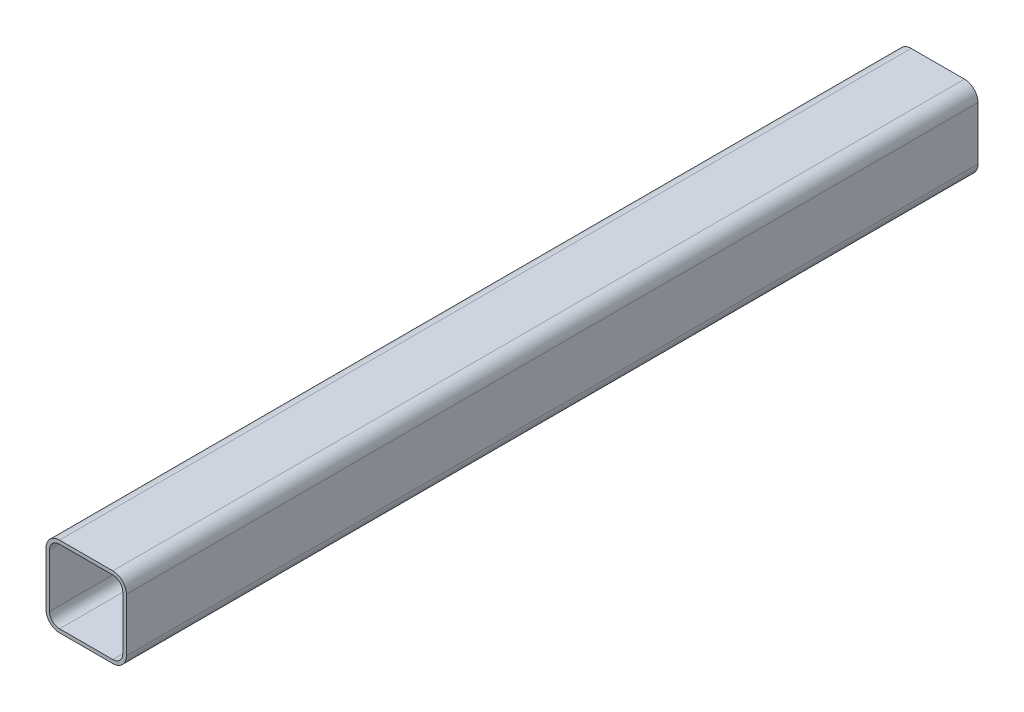
ISO-10303-21;
HEADER;
FILE_DESCRIPTION(('STEP AP214'),'2;1');
FILE_NAME('part.step','',(''),(''),'','','');
FILE_SCHEMA(('AUTOMOTIVE_DESIGN { 1 0 10303 214 1 1 1 1 }'));
ENDSEC;
DATA;
#1=APPLICATION_CONTEXT('core data for automotive mechanical design processes');
#2=APPLICATION_PROTOCOL_DEFINITION('international standard','automotive_design',2000,#1);
#3=PRODUCT_CONTEXT('',#1,'mechanical');
#4=PRODUCT('Part','Part','',(#3));
#5=PRODUCT_RELATED_PRODUCT_CATEGORY('part','',(#4));
#6=PRODUCT_DEFINITION_FORMATION('','',#4);
#7=PRODUCT_DEFINITION_CONTEXT('part definition',#1,'design');
#8=PRODUCT_DEFINITION('design','',#6,#7);
#9=PRODUCT_DEFINITION_SHAPE('','',#8);
#10=(LENGTH_UNIT() NAMED_UNIT(*) SI_UNIT(.MILLI.,.METRE.));
#11=(NAMED_UNIT(*) PLANE_ANGLE_UNIT() SI_UNIT($,.RADIAN.));
#12=(NAMED_UNIT(*) SI_UNIT($,.STERADIAN.) SOLID_ANGLE_UNIT());
#13=UNCERTAINTY_MEASURE_WITH_UNIT(LENGTH_MEASURE(1.E-05),#10,'distance_accuracy_value','');
#14=(GEOMETRIC_REPRESENTATION_CONTEXT(3) GLOBAL_UNCERTAINTY_ASSIGNED_CONTEXT((#13)) GLOBAL_UNIT_ASSIGNED_CONTEXT((#10,
#11,#12)) REPRESENTATION_CONTEXT('',''));
#15=CARTESIAN_POINT('',(0.,0.,0.));
#16=DIRECTION('',(0.,0.,1.));
#17=DIRECTION('',(1.,0.,0.));
#18=AXIS2_PLACEMENT_3D('',#15,#16,#17);
#19=CARTESIAN_POINT('',(-14.3764,-14.3764,-152.4));
#20=DIRECTION('',(0.,0.,1.));
#21=DIRECTION('',(1.,0.,0.));
#22=AXIS2_PLACEMENT_3D('',#19,#20,#21);
#23=PLANE('',#22);
#24=DIRECTION('',(0.,1.,0.));
#25=VECTOR('',#24,1.);
#26=CARTESIAN_POINT('',(-13.1064,0.,-152.4));
#27=LINE('',#26,#25);
#28=CARTESIAN_POINT('',(-13.1064,-9.53452500032133,-152.4));
#29=VERTEX_POINT('',#28);
#30=CARTESIAN_POINT('',(-13.1064,9.53452499999941,-152.4));
#31=VERTEX_POINT('',#30);
#32=EDGE_CURVE('E158',#29,#31,#27,.T.);
#33=ORIENTED_EDGE('',*,*,#32,.F.);
#34=CARTESIAN_POINT('',(-9.534525,-9.53452500000119,-152.4));
#35=DIRECTION('',(0.,0.,-1.));
#36=DIRECTION('',(0.,1.,0.));
#37=AXIS2_PLACEMENT_3D('',#34,#35,#36);
#38=CIRCLE('',#37,3.571875);
#39=CARTESIAN_POINT('',(-9.53452499931297,-13.1064,-152.4));
#40=VERTEX_POINT('',#39);
#41=EDGE_CURVE('E209',#40,#29,#38,.T.);
#42=ORIENTED_EDGE('',*,*,#41,.F.);
#43=DIRECTION('',(-1.,0.,0.));
#44=VECTOR('',#43,1.);
#45=CARTESIAN_POINT('',(0.,-13.1064,-152.4));
#46=LINE('',#45,#44);
#47=CARTESIAN_POINT('',(9.534525,-13.1064,-152.4));
#48=VERTEX_POINT('',#47);
#49=EDGE_CURVE('E154',#48,#40,#46,.T.);
#50=ORIENTED_EDGE('',*,*,#49,.F.);
#51=CARTESIAN_POINT('',(9.534525,-9.53452500000119,-152.4));
#52=DIRECTION('',(0.,0.,-1.));
#53=DIRECTION('',(0.,1.,0.));
#54=AXIS2_PLACEMENT_3D('',#51,#52,#53);
#55=CIRCLE('',#54,3.571875);
#56=CARTESIAN_POINT('',(13.1064,-9.5345250007332,-152.4));
#57=VERTEX_POINT('',#56);
#58=EDGE_CURVE('E213',#57,#48,#55,.T.);
#59=ORIENTED_EDGE('',*,*,#58,.F.);
#60=DIRECTION('',(0.,-1.,0.));
#61=VECTOR('',#60,1.);
#62=CARTESIAN_POINT('',(13.1064,0.,-152.4));
#63=LINE('',#62,#61);
#64=CARTESIAN_POINT('',(13.1064,9.53452499999941,-152.4));
#65=VERTEX_POINT('',#64);
#66=EDGE_CURVE('E163',#65,#57,#63,.T.);
#67=ORIENTED_EDGE('',*,*,#66,.F.);
#68=CARTESIAN_POINT('',(9.534525,9.53452499999882,-152.4));
#69=DIRECTION('',(0.,0.,-1.));
#70=DIRECTION('',(0.,1.,0.));
#71=AXIS2_PLACEMENT_3D('',#68,#69,#70);
#72=CIRCLE('',#71,3.571875);
#73=CARTESIAN_POINT('',(9.5345250003663,13.1064,-152.4));
#74=VERTEX_POINT('',#73);
#75=EDGE_CURVE('E216',#74,#65,#72,.T.);
#76=ORIENTED_EDGE('',*,*,#75,.F.);
#77=DIRECTION('',(1.,0.,0.));
#78=VECTOR('',#77,1.);
#79=CARTESIAN_POINT('',(0.,13.1064,-152.4));
#80=LINE('',#79,#78);
#81=CARTESIAN_POINT('',(-9.534525,13.1064,-152.4));
#82=VERTEX_POINT('',#81);
#83=EDGE_CURVE('E168',#82,#74,#80,.T.);
#84=ORIENTED_EDGE('',*,*,#83,.F.);
#85=CARTESIAN_POINT('',(-9.534525,9.53452499999882,-152.4));
#86=DIRECTION('',(0.,0.,-1.));
#87=DIRECTION('',(0.,1.,0.));
#88=AXIS2_PLACEMENT_3D('',#85,#86,#87);
#89=CIRCLE('',#88,3.571875);
#90=EDGE_CURVE('E161',#31,#82,#89,.T.);
#91=ORIENTED_EDGE('',*,*,#90,.F.);
#92=EDGE_LOOP('',(#33,#42,#50,#59,#67,#76,#84,#91));
#93=FACE_BOUND('',#92,.T.);
#94=DIRECTION('',(0.,-1.,0.));
#95=VECTOR('',#94,1.);
#96=CARTESIAN_POINT('',(14.3764,0.,-152.4));
#97=LINE('',#96,#95);
#98=CARTESIAN_POINT('',(14.3764,9.53452499999957,-152.4));
#99=VERTEX_POINT('',#98);
#100=CARTESIAN_POINT('',(14.3764,-9.53452500000044,-152.4));
#101=VERTEX_POINT('',#100);
#102=EDGE_CURVE('E162',#99,#101,#97,.T.);
#103=ORIENTED_EDGE('',*,*,#102,.T.);
#104=CARTESIAN_POINT('',(9.534525,-9.53452500000088,-152.4));
#105=DIRECTION('',(0.,0.,-1.));
#106=DIRECTION('',(0.,1.,0.));
#107=AXIS2_PLACEMENT_3D('',#104,#105,#106);
#108=CIRCLE('',#107,4.841875);
#109=CARTESIAN_POINT('',(9.53452500093131,-14.3764,-152.4));
#110=VERTEX_POINT('',#109);
#111=EDGE_CURVE('E221',#101,#110,#108,.T.);
#112=ORIENTED_EDGE('',*,*,#111,.T.);
#113=DIRECTION('',(-1.,0.,0.));
#114=VECTOR('',#113,1.);
#115=CARTESIAN_POINT('',(0.,-14.3764,-152.4));
#116=LINE('',#115,#114);
#117=CARTESIAN_POINT('',(-9.534525,-14.3764,-152.4));
#118=VERTEX_POINT('',#117);
#119=EDGE_CURVE('E174',#110,#118,#116,.T.);
#120=ORIENTED_EDGE('',*,*,#119,.T.);
#121=CARTESIAN_POINT('',(-9.534525,-9.53452500000088,-152.4));
#122=DIRECTION('',(0.,0.,-1.));
#123=DIRECTION('',(0.,1.,0.));
#124=AXIS2_PLACEMENT_3D('',#121,#122,#123);
#125=CIRCLE('',#124,4.841875);
#126=CARTESIAN_POINT('',(-14.3764,-9.53452500043521,-152.4));
#127=VERTEX_POINT('',#126);
#128=EDGE_CURVE('E225',#118,#127,#125,.T.);
#129=ORIENTED_EDGE('',*,*,#128,.T.);
#130=DIRECTION('',(0.,1.,0.));
#131=VECTOR('',#130,1.);
#132=CARTESIAN_POINT('',(-14.3764,0.,-152.4));
#133=LINE('',#132,#131);
#134=CARTESIAN_POINT('',(-14.3764,9.53452499999957,-152.4));
#135=VERTEX_POINT('',#134);
#136=EDGE_CURVE('E179',#127,#135,#133,.T.);
#137=ORIENTED_EDGE('',*,*,#136,.T.);
#138=CARTESIAN_POINT('',(-9.534525,9.53452499999913,-152.4));
#139=DIRECTION('',(0.,0.,-1.));
#140=DIRECTION('',(0.,1.,0.));
#141=AXIS2_PLACEMENT_3D('',#138,#139,#140);
#142=CIRCLE('',#141,4.841875);
#143=CARTESIAN_POINT('',(-9.53452499950346,14.3764,-152.4));
#144=VERTEX_POINT('',#143);
#145=EDGE_CURVE('E141',#135,#144,#142,.T.);
#146=ORIENTED_EDGE('',*,*,#145,.T.);
#147=DIRECTION('',(1.,0.,0.));
#148=VECTOR('',#147,1.);
#149=CARTESIAN_POINT('',(0.,14.3764,-152.4));
#150=LINE('',#149,#148);
#151=CARTESIAN_POINT('',(9.534525,14.3764,-152.4));
#152=VERTEX_POINT('',#151);
#153=EDGE_CURVE('E139',#144,#152,#150,.T.);
#154=ORIENTED_EDGE('',*,*,#153,.T.);
#155=CARTESIAN_POINT('',(9.534525,9.53452499999913,-152.4));
#156=DIRECTION('',(0.,0.,-1.));
#157=DIRECTION('',(0.,1.,0.));
#158=AXIS2_PLACEMENT_3D('',#155,#156,#157);
#159=CIRCLE('',#158,4.841875);
#160=EDGE_CURVE('E20',#152,#99,#159,.T.);
#161=ORIENTED_EDGE('',*,*,#160,.T.);
#162=EDGE_LOOP('',(#103,#112,#120,#129,#137,#146,#154,#161));
#163=FACE_BOUND('',#162,.T.);
#164=ADVANCED_FACE('F16',(#93,#163),#23,.F.);
#165=CARTESIAN_POINT('',(9.534525,9.534525,152.4));
#166=DIRECTION('',(0.,0.,-1.));
#167=DIRECTION('',(0.,1.,0.));
#168=AXIS2_PLACEMENT_3D('',#165,#166,#167);
#169=CYLINDRICAL_SURFACE('',#168,4.841875);
#170=DIRECTION('',(0.,0.,1.));
#171=VECTOR('',#170,1.);
#172=CARTESIAN_POINT('',(9.534525,14.3764,0.));
#173=LINE('',#172,#171);
#174=CARTESIAN_POINT('',(9.534525,14.3764,152.4));
#175=VERTEX_POINT('',#174);
#176=EDGE_CURVE('E131',#152,#175,#173,.T.);
#177=ORIENTED_EDGE('',*,*,#176,.T.);
#178=CARTESIAN_POINT('',(9.534525,9.534525,152.4));
#179=DIRECTION('',(0.,0.,-1.));
#180=DIRECTION('',(0.,1.,0.));
#181=AXIS2_PLACEMENT_3D('',#178,#179,#180);
#182=CIRCLE('',#181,4.841875);
#183=CARTESIAN_POINT('',(14.3764,9.534525,152.4));
#184=VERTEX_POINT('',#183);
#185=EDGE_CURVE('E207',#184,#175,#182,.F.);
#186=ORIENTED_EDGE('',*,*,#185,.F.);
#187=DIRECTION('',(0.,0.,-1.));
#188=VECTOR('',#187,1.);
#189=CARTESIAN_POINT('',(14.3764,9.534525,0.));
#190=LINE('',#189,#188);
#191=EDGE_CURVE('E134',#184,#99,#190,.T.);
#192=ORIENTED_EDGE('',*,*,#191,.T.);
#193=ORIENTED_EDGE('',*,*,#160,.F.);
#194=EDGE_LOOP('',(#177,#186,#192,#193));
#195=FACE_BOUND('',#194,.T.);
#196=ADVANCED_FACE('F129',(#195),#169,.T.);
#197=CARTESIAN_POINT('',(-9.534525,14.3764,152.4));
#198=DIRECTION('',(0.,-1.,0.));
#199=DIRECTION('',(0.,0.,-1.));
#200=AXIS2_PLACEMENT_3D('',#197,#198,#199);
#201=PLANE('',#200);
#202=DIRECTION('',(0.,0.,-1.));
#203=VECTOR('',#202,1.);
#204=CARTESIAN_POINT('',(-9.53452499900692,14.3764,0.));
#205=LINE('',#204,#203);
#206=CARTESIAN_POINT('',(-9.53452499950346,14.3764,152.4));
#207=VERTEX_POINT('',#206);
#208=EDGE_CURVE('E144',#144,#207,#205,.F.);
#209=ORIENTED_EDGE('',*,*,#208,.T.);
#210=DIRECTION('',(-1.,0.,0.));
#211=VECTOR('',#210,1.);
#212=CARTESIAN_POINT('',(0.,14.3764,152.4));
#213=LINE('',#212,#211);
#214=EDGE_CURVE('E148',#175,#207,#213,.T.);
#215=ORIENTED_EDGE('',*,*,#214,.F.);
#216=ORIENTED_EDGE('',*,*,#176,.F.);
#217=ORIENTED_EDGE('',*,*,#153,.F.);
#218=EDGE_LOOP('',(#209,#215,#216,#217));
#219=FACE_BOUND('',#218,.T.);
#220=ADVANCED_FACE('F146',(#219),#201,.F.);
#221=CARTESIAN_POINT('',(-9.534525,9.534525,152.4));
#222=DIRECTION('',(0.,0.,-1.));
#223=DIRECTION('',(0.,1.,0.));
#224=AXIS2_PLACEMENT_3D('',#221,#222,#223);
#225=CYLINDRICAL_SURFACE('',#224,4.841875);
#226=DIRECTION('',(0.,0.,1.));
#227=VECTOR('',#226,1.);
#228=CARTESIAN_POINT('',(-14.3764,9.534525,0.));
#229=LINE('',#228,#227);
#230=CARTESIAN_POINT('',(-14.3764,9.534525,152.4));
#231=VERTEX_POINT('',#230);
#232=EDGE_CURVE('E181',#135,#231,#229,.T.);
#233=ORIENTED_EDGE('',*,*,#232,.T.);
#234=CARTESIAN_POINT('',(-9.534525,9.534525,152.4));
#235=DIRECTION('',(0.,0.,-1.));
#236=DIRECTION('',(0.,1.,0.));
#237=AXIS2_PLACEMENT_3D('',#234,#235,#236);
#238=CIRCLE('',#237,4.841875);
#239=EDGE_CURVE('E204',#207,#231,#238,.F.);
#240=ORIENTED_EDGE('',*,*,#239,.F.);
#241=ORIENTED_EDGE('',*,*,#208,.F.);
#242=ORIENTED_EDGE('',*,*,#145,.F.);
#243=EDGE_LOOP('',(#233,#240,#241,#242));
#244=FACE_BOUND('',#243,.T.);
#245=ADVANCED_FACE('F229',(#244),#225,.T.);
#246=CARTESIAN_POINT('',(-14.3764,-9.534525,152.4));
#247=DIRECTION('',(1.,0.,0.));
#248=DIRECTION('',(0.,0.,-1.));
#249=AXIS2_PLACEMENT_3D('',#246,#247,#248);
#250=PLANE('',#249);
#251=DIRECTION('',(0.,0.,-1.));
#252=VECTOR('',#251,1.);
#253=CARTESIAN_POINT('',(-14.3764,-9.53452500086954,0.));
#254=LINE('',#253,#252);
#255=CARTESIAN_POINT('',(-14.3764,-9.53452500043477,152.4));
#256=VERTEX_POINT('',#255);
#257=EDGE_CURVE('E180',#127,#256,#254,.F.);
#258=ORIENTED_EDGE('',*,*,#257,.T.);
#259=DIRECTION('',(0.,-1.,0.));
#260=VECTOR('',#259,1.);
#261=CARTESIAN_POINT('',(-14.3764,0.,152.4));
#262=LINE('',#261,#260);
#263=EDGE_CURVE('E203',#231,#256,#262,.T.);
#264=ORIENTED_EDGE('',*,*,#263,.F.);
#265=ORIENTED_EDGE('',*,*,#232,.F.);
#266=ORIENTED_EDGE('',*,*,#136,.F.);
#267=EDGE_LOOP('',(#258,#264,#265,#266));
#268=FACE_BOUND('',#267,.T.);
#269=ADVANCED_FACE('F261',(#268),#250,.F.);
#270=CARTESIAN_POINT('',(-9.534525,-9.534525,152.4));
#271=DIRECTION('',(0.,0.,-1.));
#272=DIRECTION('',(0.,1.,0.));
#273=AXIS2_PLACEMENT_3D('',#270,#271,#272);
#274=CYLINDRICAL_SURFACE('',#273,4.841875);
#275=DIRECTION('',(0.,0.,1.));
#276=VECTOR('',#275,1.);
#277=CARTESIAN_POINT('',(-9.534525,-14.3764,0.));
#278=LINE('',#277,#276);
#279=CARTESIAN_POINT('',(-9.534525,-14.3764,152.4));
#280=VERTEX_POINT('',#279);
#281=EDGE_CURVE('E178',#118,#280,#278,.T.);
#282=ORIENTED_EDGE('',*,*,#281,.T.);
#283=CARTESIAN_POINT('',(-9.534525,-9.534525,152.4));
#284=DIRECTION('',(0.,0.,-1.));
#285=DIRECTION('',(0.,1.,0.));
#286=AXIS2_PLACEMENT_3D('',#283,#284,#285);
#287=CIRCLE('',#286,4.841875);
#288=EDGE_CURVE('E200',#256,#280,#287,.F.);
#289=ORIENTED_EDGE('',*,*,#288,.F.);
#290=ORIENTED_EDGE('',*,*,#257,.F.);
#291=ORIENTED_EDGE('',*,*,#128,.F.);
#292=EDGE_LOOP('',(#282,#289,#290,#291));
#293=FACE_BOUND('',#292,.T.);
#294=ADVANCED_FACE('F263',(#293),#274,.T.);
#295=CARTESIAN_POINT('',(-9.534525,-14.3764,-152.4));
#296=DIRECTION('',(0.,1.,0.));
#297=DIRECTION('',(0.,0.,1.));
#298=AXIS2_PLACEMENT_3D('',#295,#296,#297);
#299=PLANE('',#298);
#300=DIRECTION('',(0.,0.,-1.));
#301=VECTOR('',#300,1.);
#302=CARTESIAN_POINT('',(9.53452500186262,-14.3764,0.));
#303=LINE('',#302,#301);
#304=CARTESIAN_POINT('',(9.53452500093131,-14.3764,152.4));
#305=VERTEX_POINT('',#304);
#306=EDGE_CURVE('E177',#110,#305,#303,.F.);
#307=ORIENTED_EDGE('',*,*,#306,.T.);
#308=DIRECTION('',(1.,0.,0.));
#309=VECTOR('',#308,1.);
#310=CARTESIAN_POINT('',(0.,-14.3764,152.4));
#311=LINE('',#310,#309);
#312=EDGE_CURVE('E199',#280,#305,#311,.T.);
#313=ORIENTED_EDGE('',*,*,#312,.F.);
#314=ORIENTED_EDGE('',*,*,#281,.F.);
#315=ORIENTED_EDGE('',*,*,#119,.F.);
#316=EDGE_LOOP('',(#307,#313,#314,#315));
#317=FACE_BOUND('',#316,.T.);
#318=ADVANCED_FACE('F319',(#317),#299,.F.);
#319=CARTESIAN_POINT('',(9.534525,-9.534525,152.4));
#320=DIRECTION('',(0.,0.,-1.));
#321=DIRECTION('',(0.,1.,0.));
#322=AXIS2_PLACEMENT_3D('',#319,#320,#321);
#323=CYLINDRICAL_SURFACE('',#322,4.841875);
#324=DIRECTION('',(0.,0.,1.));
#325=VECTOR('',#324,1.);
#326=CARTESIAN_POINT('',(14.3764,-9.534525,0.));
#327=LINE('',#326,#325);
#328=CARTESIAN_POINT('',(14.3764,-9.534525,152.4));
#329=VERTEX_POINT('',#328);
#330=EDGE_CURVE('E224',#101,#329,#327,.T.);
#331=ORIENTED_EDGE('',*,*,#330,.T.);
#332=CARTESIAN_POINT('',(9.534525,-9.534525,152.4));
#333=DIRECTION('',(0.,0.,-1.));
#334=DIRECTION('',(0.,1.,0.));
#335=AXIS2_PLACEMENT_3D('',#332,#333,#334);
#336=CIRCLE('',#335,4.841875);
#337=EDGE_CURVE('E195',#305,#329,#336,.F.);
#338=ORIENTED_EDGE('',*,*,#337,.F.);
#339=ORIENTED_EDGE('',*,*,#306,.F.);
#340=ORIENTED_EDGE('',*,*,#111,.F.);
#341=EDGE_LOOP('',(#331,#338,#339,#340));
#342=FACE_BOUND('',#341,.T.);
#343=ADVANCED_FACE('F315',(#342),#323,.T.);
#344=CARTESIAN_POINT('',(14.3764,-9.534525,-152.4));
#345=DIRECTION('',(-1.,0.,0.));
#346=DIRECTION('',(0.,0.,1.));
#347=AXIS2_PLACEMENT_3D('',#344,#345,#346);
#348=PLANE('',#347);
#349=ORIENTED_EDGE('',*,*,#191,.F.);
#350=DIRECTION('',(0.,1.,0.));
#351=VECTOR('',#350,1.);
#352=CARTESIAN_POINT('',(14.3764,0.,152.4));
#353=LINE('',#352,#351);
#354=EDGE_CURVE('E198',#329,#184,#353,.T.);
#355=ORIENTED_EDGE('',*,*,#354,.F.);
#356=ORIENTED_EDGE('',*,*,#330,.F.);
#357=ORIENTED_EDGE('',*,*,#102,.F.);
#358=EDGE_LOOP('',(#349,#355,#356,#357));
#359=FACE_BOUND('',#358,.T.);
#360=ADVANCED_FACE('F318',(#359),#348,.F.);
#361=CARTESIAN_POINT('',(-13.1064,-9.534525,152.4));
#362=DIRECTION('',(1.,0.,0.));
#363=DIRECTION('',(0.,0.,-1.));
#364=AXIS2_PLACEMENT_3D('',#361,#362,#363);
#365=PLANE('',#364);
#366=DIRECTION('',(0.,1.,0.));
#367=VECTOR('',#366,1.);
#368=CARTESIAN_POINT('',(-13.1064000088392,0.,152.4));
#369=LINE('',#368,#367);
#370=CARTESIAN_POINT('',(-13.1064000044196,-9.53452500032073,152.4));
#371=VERTEX_POINT('',#370);
#372=CARTESIAN_POINT('',(-13.1064000044196,9.534525,152.4));
#373=VERTEX_POINT('',#372);
#374=EDGE_CURVE('E194',#371,#373,#369,.T.);
#375=ORIENTED_EDGE('',*,*,#374,.F.);
#376=DIRECTION('',(0.,0.,-1.));
#377=VECTOR('',#376,1.);
#378=CARTESIAN_POINT('',(-13.1064,-9.53452500064146,0.));
#379=LINE('',#378,#377);
#380=EDGE_CURVE('E212',#29,#371,#379,.F.);
#381=ORIENTED_EDGE('',*,*,#380,.F.);
#382=ORIENTED_EDGE('',*,*,#32,.T.);
#383=DIRECTION('',(0.,0.,1.));
#384=VECTOR('',#383,1.);
#385=CARTESIAN_POINT('',(-13.1064,9.534525,0.));
#386=LINE('',#385,#384);
#387=EDGE_CURVE('E172',#373,#31,#386,.F.);
#388=ORIENTED_EDGE('',*,*,#387,.F.);
#389=EDGE_LOOP('',(#375,#381,#382,#388));
#390=FACE_BOUND('',#389,.T.);
#391=ADVANCED_FACE('F298',(#390),#365,.T.);
#392=CARTESIAN_POINT('',(-9.534525,9.534525,152.4));
#393=DIRECTION('',(0.,0.,-1.));
#394=DIRECTION('',(0.,1.,0.));
#395=AXIS2_PLACEMENT_3D('',#392,#393,#394);
#396=CYLINDRICAL_SURFACE('',#395,3.571875);
#397=CARTESIAN_POINT('',(-9.534525,9.534525,152.4));
#398=DIRECTION('',(0.,0.,-1.));
#399=DIRECTION('',(0.,1.,0.));
#400=AXIS2_PLACEMENT_3D('',#397,#398,#399);
#401=CIRCLE('',#400,3.571875);
#402=CARTESIAN_POINT('',(-9.534525,13.1064000044196,152.4));
#403=VERTEX_POINT('',#402);
#404=EDGE_CURVE('E191',#373,#403,#401,.T.);
#405=ORIENTED_EDGE('',*,*,#404,.F.);
#406=ORIENTED_EDGE('',*,*,#387,.T.);
#407=ORIENTED_EDGE('',*,*,#90,.T.);
#408=DIRECTION('',(0.,0.,-1.));
#409=VECTOR('',#408,1.);
#410=CARTESIAN_POINT('',(-9.534525,13.1064,0.));
#411=LINE('',#410,#409);
#412=EDGE_CURVE('E171',#403,#82,#411,.T.);
#413=ORIENTED_EDGE('',*,*,#412,.F.);
#414=EDGE_LOOP('',(#405,#406,#407,#413));
#415=FACE_BOUND('',#414,.T.);
#416=ADVANCED_FACE('F295',(#415),#396,.F.);
#417=CARTESIAN_POINT('',(-9.534525,13.1064,152.4));
#418=DIRECTION('',(0.,-1.,0.));
#419=DIRECTION('',(0.,0.,-1.));
#420=AXIS2_PLACEMENT_3D('',#417,#418,#419);
#421=PLANE('',#420);
#422=DIRECTION('',(1.,0.,0.));
#423=VECTOR('',#422,1.);
#424=CARTESIAN_POINT('',(0.,13.1064000088392,152.4));
#425=LINE('',#424,#423);
#426=CARTESIAN_POINT('',(9.5345250003663,13.1064000044196,152.4));
#427=VERTEX_POINT('',#426);
#428=EDGE_CURVE('E190',#403,#427,#425,.T.);
#429=ORIENTED_EDGE('',*,*,#428,.F.);
#430=ORIENTED_EDGE('',*,*,#412,.T.);
#431=ORIENTED_EDGE('',*,*,#83,.T.);
#432=DIRECTION('',(0.,0.,1.));
#433=VECTOR('',#432,1.);
#434=CARTESIAN_POINT('',(9.53452500073261,13.1064,0.));
#435=LINE('',#434,#433);
#436=EDGE_CURVE('E167',#427,#74,#435,.F.);
#437=ORIENTED_EDGE('',*,*,#436,.F.);
#438=EDGE_LOOP('',(#429,#430,#431,#437));
#439=FACE_BOUND('',#438,.T.);
#440=ADVANCED_FACE('F292',(#439),#421,.T.);
#441=CARTESIAN_POINT('',(9.534525,9.534525,152.4));
#442=DIRECTION('',(0.,0.,-1.));
#443=DIRECTION('',(0.,1.,0.));
#444=AXIS2_PLACEMENT_3D('',#441,#442,#443);
#445=CYLINDRICAL_SURFACE('',#444,3.571875);
#446=CARTESIAN_POINT('',(9.534525,9.534525,152.4));
#447=DIRECTION('',(0.,0.,-1.));
#448=DIRECTION('',(0.,1.,0.));
#449=AXIS2_PLACEMENT_3D('',#446,#447,#448);
#450=CIRCLE('',#449,3.571875);
#451=CARTESIAN_POINT('',(13.1064000044196,9.534525,152.4));
#452=VERTEX_POINT('',#451);
#453=EDGE_CURVE('E187',#427,#452,#450,.T.);
#454=ORIENTED_EDGE('',*,*,#453,.F.);
#455=ORIENTED_EDGE('',*,*,#436,.T.);
#456=ORIENTED_EDGE('',*,*,#75,.T.);
#457=DIRECTION('',(0.,0.,-1.));
#458=VECTOR('',#457,1.);
#459=CARTESIAN_POINT('',(13.1064,9.534525,0.));
#460=LINE('',#459,#458);
#461=EDGE_CURVE('E166',#452,#65,#460,.T.);
#462=ORIENTED_EDGE('',*,*,#461,.F.);
#463=EDGE_LOOP('',(#454,#455,#456,#462));
#464=FACE_BOUND('',#463,.T.);
#465=ADVANCED_FACE('F289',(#464),#445,.F.);
#466=CARTESIAN_POINT('',(13.1064,-9.534525,-152.4));
#467=DIRECTION('',(-1.,0.,0.));
#468=DIRECTION('',(0.,0.,1.));
#469=AXIS2_PLACEMENT_3D('',#466,#467,#468);
#470=PLANE('',#469);
#471=DIRECTION('',(0.,-1.,0.));
#472=VECTOR('',#471,1.);
#473=CARTESIAN_POINT('',(13.1064000088392,0.,152.4));
#474=LINE('',#473,#472);
#475=CARTESIAN_POINT('',(13.1064000044196,-9.53452500073261,152.4));
#476=VERTEX_POINT('',#475);
#477=EDGE_CURVE('E186',#452,#476,#474,.T.);
#478=ORIENTED_EDGE('',*,*,#477,.F.);
#479=ORIENTED_EDGE('',*,*,#461,.T.);
#480=ORIENTED_EDGE('',*,*,#66,.T.);
#481=DIRECTION('',(0.,0.,1.));
#482=VECTOR('',#481,1.);
#483=CARTESIAN_POINT('',(13.1064,-9.53452500146521,0.));
#484=LINE('',#483,#482);
#485=EDGE_CURVE('E157',#476,#57,#484,.F.);
#486=ORIENTED_EDGE('',*,*,#485,.F.);
#487=EDGE_LOOP('',(#478,#479,#480,#486));
#488=FACE_BOUND('',#487,.T.);
#489=ADVANCED_FACE('F286',(#488),#470,.T.);
#490=CARTESIAN_POINT('',(9.534525,-9.534525,152.4));
#491=DIRECTION('',(0.,0.,-1.));
#492=DIRECTION('',(0.,1.,0.));
#493=AXIS2_PLACEMENT_3D('',#490,#491,#492);
#494=CYLINDRICAL_SURFACE('',#493,3.571875);
#495=CARTESIAN_POINT('',(9.534525,-9.534525,152.4));
#496=DIRECTION('',(0.,0.,-1.));
#497=DIRECTION('',(0.,1.,0.));
#498=AXIS2_PLACEMENT_3D('',#495,#496,#497);
#499=CIRCLE('',#498,3.571875);
#500=CARTESIAN_POINT('',(9.534525,-13.1064000044196,152.4));
#501=VERTEX_POINT('',#500);
#502=EDGE_CURVE('E183',#476,#501,#499,.T.);
#503=ORIENTED_EDGE('',*,*,#502,.F.);
#504=ORIENTED_EDGE('',*,*,#485,.T.);
#505=ORIENTED_EDGE('',*,*,#58,.T.);
#506=DIRECTION('',(0.,0.,-1.));
#507=VECTOR('',#506,1.);
#508=CARTESIAN_POINT('',(9.534525,-13.1064,0.));
#509=LINE('',#508,#507);
#510=EDGE_CURVE('E156',#501,#48,#509,.T.);
#511=ORIENTED_EDGE('',*,*,#510,.F.);
#512=EDGE_LOOP('',(#503,#504,#505,#511));
#513=FACE_BOUND('',#512,.T.);
#514=ADVANCED_FACE('F282',(#513),#494,.F.);
#515=CARTESIAN_POINT('',(-9.534525,-13.1064,-152.4));
#516=DIRECTION('',(0.,1.,0.));
#517=DIRECTION('',(0.,0.,1.));
#518=AXIS2_PLACEMENT_3D('',#515,#516,#517);
#519=PLANE('',#518);
#520=DIRECTION('',(-1.,0.,0.));
#521=VECTOR('',#520,1.);
#522=CARTESIAN_POINT('',(0.,-13.1064000088392,152.4));
#523=LINE('',#522,#521);
#524=CARTESIAN_POINT('',(-9.53452499931297,-13.1064000044196,152.4));
#525=VERTEX_POINT('',#524);
#526=EDGE_CURVE('E26',#501,#525,#523,.T.);
#527=ORIENTED_EDGE('',*,*,#526,.F.);
#528=ORIENTED_EDGE('',*,*,#510,.T.);
#529=ORIENTED_EDGE('',*,*,#49,.T.);
#530=DIRECTION('',(0.,0.,1.));
#531=VECTOR('',#530,1.);
#532=CARTESIAN_POINT('',(-9.53452499862594,-13.1064,0.));
#533=LINE('',#532,#531);
#534=EDGE_CURVE('E35',#525,#40,#533,.F.);
#535=ORIENTED_EDGE('',*,*,#534,.F.);
#536=EDGE_LOOP('',(#527,#528,#529,#535));
#537=FACE_BOUND('',#536,.T.);
#538=ADVANCED_FACE('F280',(#537),#519,.T.);
#539=CARTESIAN_POINT('',(-9.534525,-9.534525,152.4));
#540=DIRECTION('',(0.,0.,-1.));
#541=DIRECTION('',(0.,1.,0.));
#542=AXIS2_PLACEMENT_3D('',#539,#540,#541);
#543=CYLINDRICAL_SURFACE('',#542,3.571875);
#544=CARTESIAN_POINT('',(-9.534525,-9.534525,152.4));
#545=DIRECTION('',(0.,0.,-1.));
#546=DIRECTION('',(0.,1.,0.));
#547=AXIS2_PLACEMENT_3D('',#544,#545,#546);
#548=CIRCLE('',#547,3.571875);
#549=EDGE_CURVE('E10',#525,#371,#548,.T.);
#550=ORIENTED_EDGE('',*,*,#549,.F.);
#551=ORIENTED_EDGE('',*,*,#534,.T.);
#552=ORIENTED_EDGE('',*,*,#41,.T.);
#553=ORIENTED_EDGE('',*,*,#380,.T.);
#554=EDGE_LOOP('',(#550,#551,#552,#553));
#555=FACE_BOUND('',#554,.T.);
#556=ADVANCED_FACE('F300',(#555),#543,.F.);
#557=CARTESIAN_POINT('',(-14.3764,-14.3764,152.4));
#558=DIRECTION('',(0.,0.,1.));
#559=DIRECTION('',(1.,0.,0.));
#560=AXIS2_PLACEMENT_3D('',#557,#558,#559);
#561=PLANE('',#560);
#562=ORIENTED_EDGE('',*,*,#526,.T.);
#563=ORIENTED_EDGE('',*,*,#549,.T.);
#564=ORIENTED_EDGE('',*,*,#374,.T.);
#565=ORIENTED_EDGE('',*,*,#404,.T.);
#566=ORIENTED_EDGE('',*,*,#428,.T.);
#567=ORIENTED_EDGE('',*,*,#453,.T.);
#568=ORIENTED_EDGE('',*,*,#477,.T.);
#569=ORIENTED_EDGE('',*,*,#502,.T.);
#570=EDGE_LOOP('',(#562,#563,#564,#565,#566,#567,#568,#569));
#571=FACE_BOUND('',#570,.T.);
#572=ORIENTED_EDGE('',*,*,#337,.T.);
#573=ORIENTED_EDGE('',*,*,#354,.T.);
#574=ORIENTED_EDGE('',*,*,#185,.T.);
#575=ORIENTED_EDGE('',*,*,#214,.T.);
#576=ORIENTED_EDGE('',*,*,#239,.T.);
#577=ORIENTED_EDGE('',*,*,#263,.T.);
#578=ORIENTED_EDGE('',*,*,#288,.T.);
#579=ORIENTED_EDGE('',*,*,#312,.T.);
#580=EDGE_LOOP('',(#572,#573,#574,#575,#576,#577,#578,#579));
#581=FACE_BOUND('',#580,.T.);
#582=ADVANCED_FACE('F18',(#571,#581),#561,.T.);
#583=CLOSED_SHELL('',(#164,#196,#220,#245,#269,#294,#318,#343,#360,#391,#416,#440,#465,#489,
#514,#538,#556,#582));
#584=MANIFOLD_SOLID_BREP('B1',#583);
#585=ADVANCED_BREP_SHAPE_REPRESENTATION('',(#18,#584),#14);
#586=SHAPE_DEFINITION_REPRESENTATION(#9,#585);
ENDSEC;
END-ISO-10303-21;
